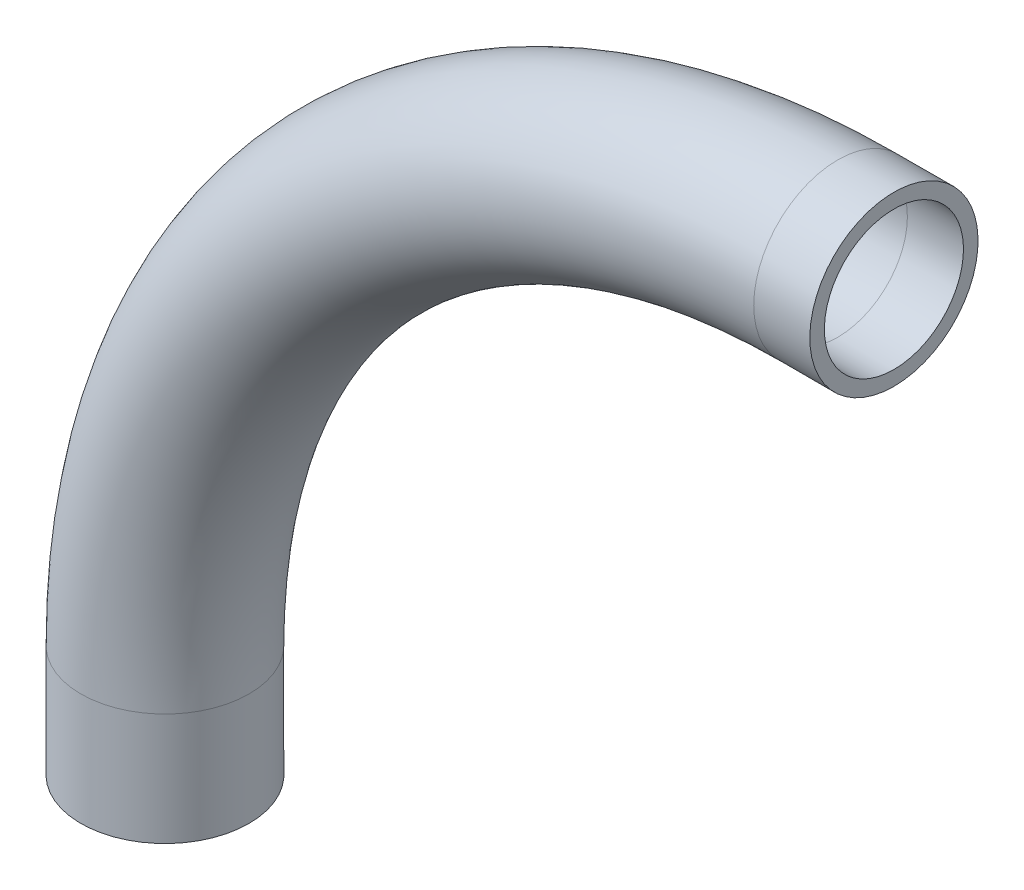
ISO-10303-21;
HEADER;
FILE_DESCRIPTION(('STEP AP214'),'2;1');
FILE_NAME('part.step','',(''),(''),'','','');
FILE_SCHEMA(('AUTOMOTIVE_DESIGN { 1 0 10303 214 1 1 1 1 }'));
ENDSEC;
DATA;
#1=APPLICATION_CONTEXT('core data for automotive mechanical design processes');
#2=APPLICATION_PROTOCOL_DEFINITION('international standard','automotive_design',2000,#1);
#3=PRODUCT_CONTEXT('',#1,'mechanical');
#4=PRODUCT('Part','Part','',(#3));
#5=PRODUCT_RELATED_PRODUCT_CATEGORY('part','',(#4));
#6=PRODUCT_DEFINITION_FORMATION('','',#4);
#7=PRODUCT_DEFINITION_CONTEXT('part definition',#1,'design');
#8=PRODUCT_DEFINITION('design','',#6,#7);
#9=PRODUCT_DEFINITION_SHAPE('','',#8);
#10=(LENGTH_UNIT() NAMED_UNIT(*) SI_UNIT(.MILLI.,.METRE.));
#11=(NAMED_UNIT(*) PLANE_ANGLE_UNIT() SI_UNIT($,.RADIAN.));
#12=(NAMED_UNIT(*) SI_UNIT($,.STERADIAN.) SOLID_ANGLE_UNIT());
#13=UNCERTAINTY_MEASURE_WITH_UNIT(LENGTH_MEASURE(1.E-05),#10,'distance_accuracy_value','');
#14=(GEOMETRIC_REPRESENTATION_CONTEXT(3) GLOBAL_UNCERTAINTY_ASSIGNED_CONTEXT((#13)) GLOBAL_UNIT_ASSIGNED_CONTEXT((#10,
#11,#12)) REPRESENTATION_CONTEXT('',''));
#15=CARTESIAN_POINT('',(0.,0.,0.));
#16=DIRECTION('',(0.,0.,1.));
#17=DIRECTION('',(1.,0.,0.));
#18=AXIS2_PLACEMENT_3D('',#15,#16,#17);
#19=CARTESIAN_POINT('',(6.34999999999966,0.,0.));
#20=DIRECTION('',(-1.,0.,0.));
#21=DIRECTION('',(0.,-1.,0.));
#22=AXIS2_PLACEMENT_3D('',#19,#20,#21);
#23=CYLINDRICAL_SURFACE('',#22,9.525);
#24=CARTESIAN_POINT('',(0.,0.,0.));
#25=DIRECTION('',(-1.,0.,0.));
#26=DIRECTION('',(0.,-1.,0.));
#27=AXIS2_PLACEMENT_3D('',#24,#25,#26);
#28=CIRCLE('',#27,9.525);
#29=CARTESIAN_POINT('',(0.,9.52499999999999,0.));
#30=VERTEX_POINT('',#29);
#31=EDGE_CURVE('E66',#30,#30,#28,.T.);
#32=ORIENTED_EDGE('',*,*,#31,.F.);
#33=EDGE_LOOP('',(#32));
#34=FACE_BOUND('',#33,.T.);
#35=CARTESIAN_POINT('',(6.34999999999966,0.,0.));
#36=DIRECTION('',(-1.,0.,0.));
#37=DIRECTION('',(0.,-1.,0.));
#38=AXIS2_PLACEMENT_3D('',#35,#36,#37);
#39=CIRCLE('',#38,9.525);
#40=CARTESIAN_POINT('',(6.34999999999966,-9.525,0.));
#41=VERTEX_POINT('',#40);
#42=EDGE_CURVE('E63',#41,#41,#39,.T.);
#43=ORIENTED_EDGE('',*,*,#42,.T.);
#44=EDGE_LOOP('',(#43));
#45=FACE_BOUND('',#44,.T.);
#46=ADVANCED_FACE('F39',(#34,#45),#23,.T.);
#47=CARTESIAN_POINT('',(0.,-76.2,0.));
#48=DIRECTION('',(0.,0.,1.));
#49=DIRECTION('',(1.,0.,0.));
#50=AXIS2_PLACEMENT_3D('',#47,#48,#49);
#51=TOROIDAL_SURFACE('',#50,76.2,9.525);
#52=CARTESIAN_POINT('',(-76.2,-76.2000000000003,0.));
#53=DIRECTION('',(0.,-1.,0.));
#54=DIRECTION('',(1.,0.,0.));
#55=AXIS2_PLACEMENT_3D('',#52,#53,#54);
#56=CIRCLE('',#55,9.525);
#57=CARTESIAN_POINT('',(-85.725,-76.2000000000003,0.));
#58=VERTEX_POINT('',#57);
#59=EDGE_CURVE('E43',#58,#58,#56,.T.);
#60=CARTESIAN_POINT('',(0.,-76.2,0.));
#61=DIRECTION('',(0.,0.,1.));
#62=DIRECTION('',(1.,0.,0.));
#63=AXIS2_PLACEMENT_3D('',#60,#61,#62);
#64=CIRCLE('',#63,85.725);
#65=EDGE_CURVE('',#30,#58,#64,.T.);
#66=ORIENTED_EDGE('',*,*,#31,.T.);
#67=ORIENTED_EDGE('',*,*,#59,.F.);
#68=ORIENTED_EDGE('',*,*,#65,.T.);
#69=ORIENTED_EDGE('',*,*,#65,.F.);
#70=EDGE_LOOP('',(#66,#68,#67,#69));
#71=FACE_BOUND('',#70,.T.);
#72=ADVANCED_FACE('F76',(#71),#51,.T.);
#73=CARTESIAN_POINT('',(-76.2,-76.2000000000003,0.));
#74=DIRECTION('',(0.,-1.,0.));
#75=DIRECTION('',(1.,0.,0.));
#76=AXIS2_PLACEMENT_3D('',#73,#74,#75);
#77=CYLINDRICAL_SURFACE('',#76,9.525);
#78=CARTESIAN_POINT('',(-76.2,-88.9,0.));
#79=DIRECTION('',(0.,-1.,0.));
#80=DIRECTION('',(1.,0.,0.));
#81=AXIS2_PLACEMENT_3D('',#78,#79,#80);
#82=CIRCLE('',#81,9.525);
#83=CARTESIAN_POINT('',(-66.675,-88.9,0.));
#84=VERTEX_POINT('',#83);
#85=EDGE_CURVE('E58',#84,#84,#82,.T.);
#86=ORIENTED_EDGE('',*,*,#85,.F.);
#87=EDGE_LOOP('',(#86));
#88=FACE_BOUND('',#87,.T.);
#89=ORIENTED_EDGE('',*,*,#59,.T.);
#90=EDGE_LOOP('',(#89));
#91=FACE_BOUND('',#90,.T.);
#92=ADVANCED_FACE('F41',(#88,#91),#77,.T.);
#93=CARTESIAN_POINT('',(6.34999999999966,0.,0.));
#94=DIRECTION('',(-1.,0.,0.));
#95=DIRECTION('',(0.,-1.,0.));
#96=AXIS2_PLACEMENT_3D('',#93,#94,#95);
#97=PLANE('',#96);
#98=CARTESIAN_POINT('',(6.34999999999966,0.,0.));
#99=DIRECTION('',(-1.,0.,0.));
#100=DIRECTION('',(0.,-1.,0.));
#101=AXIS2_PLACEMENT_3D('',#98,#99,#100);
#102=CIRCLE('',#101,7.874);
#103=CARTESIAN_POINT('',(6.34999999999966,-7.874,0.));
#104=VERTEX_POINT('',#103);
#105=EDGE_CURVE('E62',#104,#104,#102,.F.);
#106=ORIENTED_EDGE('',*,*,#105,.F.);
#107=EDGE_LOOP('',(#106));
#108=FACE_BOUND('',#107,.T.);
#109=ORIENTED_EDGE('',*,*,#42,.F.);
#110=EDGE_LOOP('',(#109));
#111=FACE_BOUND('',#110,.T.);
#112=ADVANCED_FACE('F82',(#108,#111),#97,.F.);
#113=CARTESIAN_POINT('',(-76.2,-88.9,0.));
#114=DIRECTION('',(0.,-1.,0.));
#115=DIRECTION('',(1.,0.,0.));
#116=AXIS2_PLACEMENT_3D('',#113,#114,#115);
#117=PLANE('',#116);
#118=CARTESIAN_POINT('',(-76.2,-88.9,0.));
#119=DIRECTION('',(0.,-1.,0.));
#120=DIRECTION('',(1.,0.,0.));
#121=AXIS2_PLACEMENT_3D('',#118,#119,#120);
#122=CIRCLE('',#121,7.874);
#123=CARTESIAN_POINT('',(-68.326,-88.9,0.));
#124=VERTEX_POINT('',#123);
#125=EDGE_CURVE('E10',#124,#124,#122,.F.);
#126=ORIENTED_EDGE('',*,*,#125,.T.);
#127=EDGE_LOOP('',(#126));
#128=FACE_BOUND('',#127,.T.);
#129=ORIENTED_EDGE('',*,*,#85,.T.);
#130=EDGE_LOOP('',(#129));
#131=FACE_BOUND('',#130,.T.);
#132=ADVANCED_FACE('F100',(#128,#131),#117,.T.);
#133=CARTESIAN_POINT('',(6.34999999999966,0.,0.));
#134=DIRECTION('',(-1.,0.,0.));
#135=DIRECTION('',(0.,-1.,0.));
#136=AXIS2_PLACEMENT_3D('',#133,#134,#135);
#137=CYLINDRICAL_SURFACE('',#136,7.874);
#138=CARTESIAN_POINT('',(0.,0.,0.));
#139=DIRECTION('',(-1.,0.,0.));
#140=DIRECTION('',(0.,-1.,0.));
#141=AXIS2_PLACEMENT_3D('',#138,#139,#140);
#142=CIRCLE('',#141,7.874);
#143=CARTESIAN_POINT('',(0.,7.87399999999999,0.));
#144=VERTEX_POINT('',#143);
#145=EDGE_CURVE('E54',#144,#144,#142,.F.);
#146=ORIENTED_EDGE('',*,*,#145,.F.);
#147=EDGE_LOOP('',(#146));
#148=FACE_BOUND('',#147,.T.);
#149=ORIENTED_EDGE('',*,*,#105,.T.);
#150=EDGE_LOOP('',(#149));
#151=FACE_BOUND('',#150,.T.);
#152=ADVANCED_FACE('F94',(#148,#151),#137,.F.);
#153=CARTESIAN_POINT('',(0.,-76.2,0.));
#154=DIRECTION('',(0.,0.,1.));
#155=DIRECTION('',(1.,0.,0.));
#156=AXIS2_PLACEMENT_3D('',#153,#154,#155);
#157=TOROIDAL_SURFACE('',#156,76.2,7.874);
#158=CARTESIAN_POINT('',(-76.2,-76.2000000000003,0.));
#159=DIRECTION('',(0.,-1.,0.));
#160=DIRECTION('',(1.,0.,0.));
#161=AXIS2_PLACEMENT_3D('',#158,#159,#160);
#162=CIRCLE('',#161,7.874);
#163=CARTESIAN_POINT('',(-84.074,-76.2000000000003,0.));
#164=VERTEX_POINT('',#163);
#165=EDGE_CURVE('E48',#164,#164,#162,.F.);
#166=CARTESIAN_POINT('',(0.,-76.2,0.));
#167=DIRECTION('',(0.,0.,1.));
#168=DIRECTION('',(1.,0.,0.));
#169=AXIS2_PLACEMENT_3D('',#166,#167,#168);
#170=CIRCLE('',#169,84.074);
#171=EDGE_CURVE('',#144,#164,#170,.T.);
#172=ORIENTED_EDGE('',*,*,#145,.T.);
#173=ORIENTED_EDGE('',*,*,#165,.F.);
#174=ORIENTED_EDGE('',*,*,#171,.T.);
#175=ORIENTED_EDGE('',*,*,#171,.F.);
#176=EDGE_LOOP('',(#172,#174,#173,#175));
#177=FACE_BOUND('',#176,.T.);
#178=ADVANCED_FACE('F88',(#177),#157,.F.);
#179=CARTESIAN_POINT('',(-76.2,-76.2000000000003,0.));
#180=DIRECTION('',(0.,-1.,0.));
#181=DIRECTION('',(1.,0.,0.));
#182=AXIS2_PLACEMENT_3D('',#179,#180,#181);
#183=CYLINDRICAL_SURFACE('',#182,7.874);
#184=ORIENTED_EDGE('',*,*,#125,.F.);
#185=EDGE_LOOP('',(#184));
#186=FACE_BOUND('',#185,.T.);
#187=ORIENTED_EDGE('',*,*,#165,.T.);
#188=EDGE_LOOP('',(#187));
#189=FACE_BOUND('',#188,.T.);
#190=ADVANCED_FACE('F86',(#186,#189),#183,.F.);
#191=CLOSED_SHELL('',(#46,#72,#92,#112,#132,#152,#178,#190));
#192=MANIFOLD_SOLID_BREP('B2',#191);
#193=ADVANCED_BREP_SHAPE_REPRESENTATION('',(#18,#192),#14);
#194=SHAPE_DEFINITION_REPRESENTATION(#9,#193);
ENDSEC;
END-ISO-10303-21;
